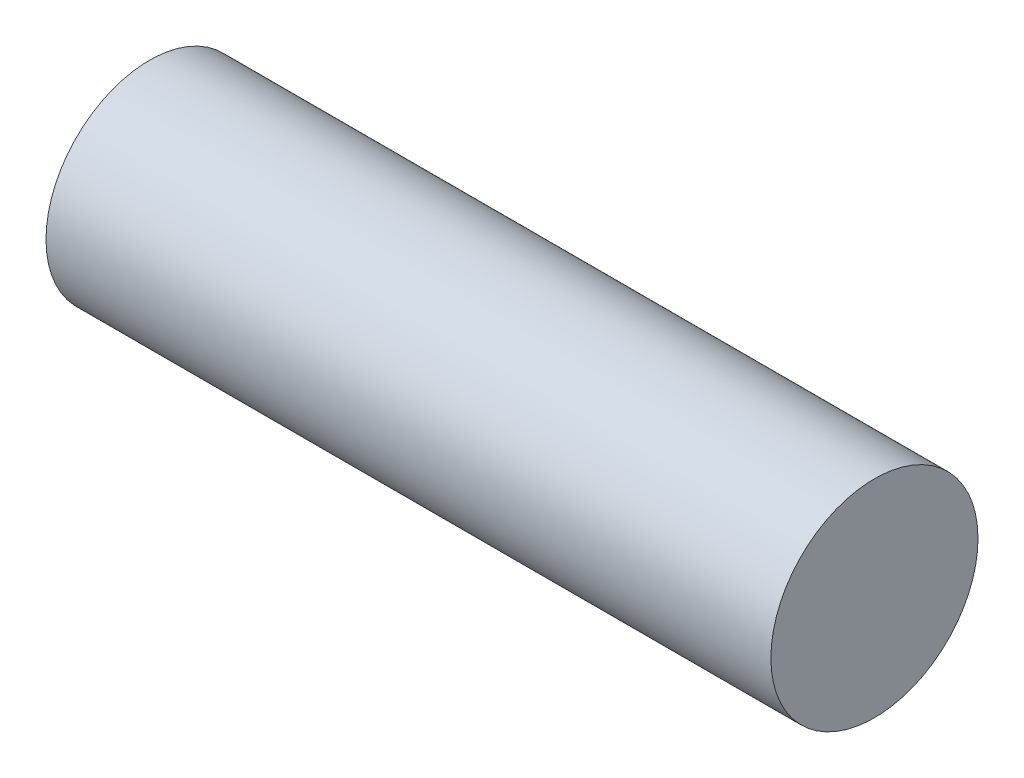
ISO-10303-21;
HEADER;
FILE_DESCRIPTION(('STEP AP214'),'2;1');
FILE_NAME('part.step','',(''),(''),'','','');
FILE_SCHEMA(('AUTOMOTIVE_DESIGN { 1 0 10303 214 1 1 1 1 }'));
ENDSEC;
DATA;
#1=APPLICATION_CONTEXT('core data for automotive mechanical design processes');
#2=APPLICATION_PROTOCOL_DEFINITION('international standard','automotive_design',2000,#1);
#3=PRODUCT_CONTEXT('',#1,'mechanical');
#4=PRODUCT('Part','Part','',(#3));
#5=PRODUCT_RELATED_PRODUCT_CATEGORY('part','',(#4));
#6=PRODUCT_DEFINITION_FORMATION('','',#4);
#7=PRODUCT_DEFINITION_CONTEXT('part definition',#1,'design');
#8=PRODUCT_DEFINITION('design','',#6,#7);
#9=PRODUCT_DEFINITION_SHAPE('','',#8);
#10=(LENGTH_UNIT() NAMED_UNIT(*) SI_UNIT(.MILLI.,.METRE.));
#11=(NAMED_UNIT(*) PLANE_ANGLE_UNIT() SI_UNIT($,.RADIAN.));
#12=(NAMED_UNIT(*) SI_UNIT($,.STERADIAN.) SOLID_ANGLE_UNIT());
#13=UNCERTAINTY_MEASURE_WITH_UNIT(LENGTH_MEASURE(1.E-05),#10,'distance_accuracy_value','');
#14=(GEOMETRIC_REPRESENTATION_CONTEXT(3) GLOBAL_UNCERTAINTY_ASSIGNED_CONTEXT((#13)) GLOBAL_UNIT_ASSIGNED_CONTEXT((#10,
#11,#12)) REPRESENTATION_CONTEXT('',''));
#15=CARTESIAN_POINT('',(0.,0.,0.));
#16=DIRECTION('',(0.,0.,1.));
#17=DIRECTION('',(1.,0.,0.));
#18=AXIS2_PLACEMENT_3D('',#15,#16,#17);
#19=CARTESIAN_POINT('',(22.225,0.,0.));
#20=DIRECTION('',(-1.,0.,0.));
#21=DIRECTION('',(0.,0.,1.));
#22=AXIS2_PLACEMENT_3D('',#19,#20,#21);
#23=CYLINDRICAL_SURFACE('',#22,6.35);
#24=CARTESIAN_POINT('',(22.225,0.,0.));
#25=DIRECTION('',(1.,0.,0.));
#26=DIRECTION('',(0.,0.,-1.));
#27=AXIS2_PLACEMENT_3D('',#24,#25,#26);
#28=CIRCLE('',#27,6.35);
#29=CARTESIAN_POINT('',(22.225,0.,-6.35));
#30=VERTEX_POINT('',#29);
#31=EDGE_CURVE('E11',#30,#30,#28,.T.);
#32=ORIENTED_EDGE('',*,*,#31,.F.);
#33=EDGE_LOOP('',(#32));
#34=FACE_BOUND('',#33,.T.);
#35=CARTESIAN_POINT('',(-22.225,0.,0.));
#36=DIRECTION('',(1.,0.,0.));
#37=DIRECTION('',(0.,0.,-1.));
#38=AXIS2_PLACEMENT_3D('',#35,#36,#37);
#39=CIRCLE('',#38,6.35);
#40=CARTESIAN_POINT('',(-22.225,0.,-6.35));
#41=VERTEX_POINT('',#40);
#42=EDGE_CURVE('E37',#41,#41,#39,.T.);
#43=ORIENTED_EDGE('',*,*,#42,.T.);
#44=EDGE_LOOP('',(#43));
#45=FACE_BOUND('',#44,.T.);
#46=ADVANCED_FACE('F34',(#34,#45),#23,.T.);
#47=CARTESIAN_POINT('',(22.225,0.,0.));
#48=DIRECTION('',(1.,0.,0.));
#49=DIRECTION('',(0.,0.,-1.));
#50=AXIS2_PLACEMENT_3D('',#47,#48,#49);
#51=PLANE('',#50);
#52=ORIENTED_EDGE('',*,*,#31,.T.);
#53=EDGE_LOOP('',(#52));
#54=FACE_BOUND('',#53,.T.);
#55=ADVANCED_FACE('F51',(#54),#51,.T.);
#56=CARTESIAN_POINT('',(-22.225,0.,0.));
#57=DIRECTION('',(1.,0.,0.));
#58=DIRECTION('',(0.,0.,-1.));
#59=AXIS2_PLACEMENT_3D('',#56,#57,#58);
#60=PLANE('',#59);
#61=ORIENTED_EDGE('',*,*,#42,.F.);
#62=EDGE_LOOP('',(#61));
#63=FACE_BOUND('',#62,.T.);
#64=ADVANCED_FACE('F49',(#63),#60,.F.);
#65=CLOSED_SHELL('',(#46,#55,#64));
#66=MANIFOLD_SOLID_BREP('B2',#65);
#67=ADVANCED_BREP_SHAPE_REPRESENTATION('',(#18,#66),#14);
#68=SHAPE_DEFINITION_REPRESENTATION(#9,#67);
ENDSEC;
END-ISO-10303-21;
